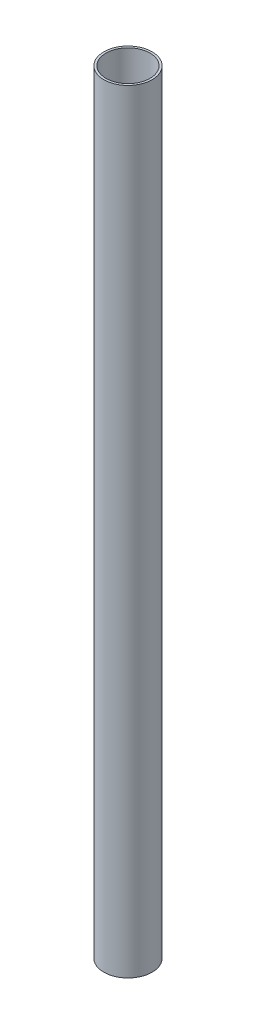
ISO-10303-21;
HEADER;
FILE_DESCRIPTION(('STEP AP214'),'2;1');
FILE_NAME('part.step','',(''),(''),'','','');
FILE_SCHEMA(('AUTOMOTIVE_DESIGN { 1 0 10303 214 1 1 1 1 }'));
ENDSEC;
DATA;
#1=APPLICATION_CONTEXT('core data for automotive mechanical design processes');
#2=APPLICATION_PROTOCOL_DEFINITION('international standard','automotive_design',2000,#1);
#3=PRODUCT_CONTEXT('',#1,'mechanical');
#4=PRODUCT('Part','Part','',(#3));
#5=PRODUCT_RELATED_PRODUCT_CATEGORY('part','',(#4));
#6=PRODUCT_DEFINITION_FORMATION('','',#4);
#7=PRODUCT_DEFINITION_CONTEXT('part definition',#1,'design');
#8=PRODUCT_DEFINITION('design','',#6,#7);
#9=PRODUCT_DEFINITION_SHAPE('','',#8);
#10=(LENGTH_UNIT() NAMED_UNIT(*) SI_UNIT(.MILLI.,.METRE.));
#11=(NAMED_UNIT(*) PLANE_ANGLE_UNIT() SI_UNIT($,.RADIAN.));
#12=(NAMED_UNIT(*) SI_UNIT($,.STERADIAN.) SOLID_ANGLE_UNIT());
#13=UNCERTAINTY_MEASURE_WITH_UNIT(LENGTH_MEASURE(1.E-05),#10,'distance_accuracy_value','');
#14=(GEOMETRIC_REPRESENTATION_CONTEXT(3) GLOBAL_UNCERTAINTY_ASSIGNED_CONTEXT((#13)) GLOBAL_UNIT_ASSIGNED_CONTEXT((#10,
#11,#12)) REPRESENTATION_CONTEXT('',''));
#15=CARTESIAN_POINT('',(0.,0.,0.));
#16=DIRECTION('',(0.,0.,1.));
#17=DIRECTION('',(1.,0.,0.));
#18=AXIS2_PLACEMENT_3D('',#15,#16,#17);
#19=CARTESIAN_POINT('',(0.,254.,0.));
#20=DIRECTION('',(0.,1.,0.));
#21=DIRECTION('',(0.,0.,1.));
#22=AXIS2_PLACEMENT_3D('',#19,#20,#21);
#23=PLANE('',#22);
#24=CARTESIAN_POINT('',(0.,254.,0.));
#25=DIRECTION('',(0.,1.,0.));
#26=DIRECTION('',(0.,0.,1.));
#27=AXIS2_PLACEMENT_3D('',#24,#25,#26);
#28=CIRCLE('',#27,7.9375);
#29=CARTESIAN_POINT('',(0.,254.,7.9375));
#30=VERTEX_POINT('',#29);
#31=EDGE_CURVE('E10',#30,#30,#28,.T.);
#32=ORIENTED_EDGE('',*,*,#31,.T.);
#33=EDGE_LOOP('',(#32));
#34=FACE_BOUND('',#33,.T.);
#35=CARTESIAN_POINT('',(0.,254.,0.));
#36=DIRECTION('',(0.,1.,0.));
#37=DIRECTION('',(0.,0.,1.));
#38=AXIS2_PLACEMENT_3D('',#35,#36,#37);
#39=CIRCLE('',#38,7.2263);
#40=CARTESIAN_POINT('',(0.,254.,7.2263));
#41=VERTEX_POINT('',#40);
#42=EDGE_CURVE('E42',#41,#41,#39,.T.);
#43=ORIENTED_EDGE('',*,*,#42,.F.);
#44=EDGE_LOOP('',(#43));
#45=FACE_BOUND('',#44,.T.);
#46=ADVANCED_FACE('F31',(#34,#45),#23,.T.);
#47=CARTESIAN_POINT('',(0.,0.,0.));
#48=DIRECTION('',(0.,1.,0.));
#49=DIRECTION('',(0.,0.,1.));
#50=AXIS2_PLACEMENT_3D('',#47,#48,#49);
#51=PLANE('',#50);
#52=CARTESIAN_POINT('',(0.,0.,0.));
#53=DIRECTION('',(0.,1.,0.));
#54=DIRECTION('',(0.,0.,1.));
#55=AXIS2_PLACEMENT_3D('',#52,#53,#54);
#56=CIRCLE('',#55,7.9375);
#57=CARTESIAN_POINT('',(0.,0.,7.9375));
#58=VERTEX_POINT('',#57);
#59=EDGE_CURVE('E35',#58,#58,#56,.T.);
#60=ORIENTED_EDGE('',*,*,#59,.F.);
#61=EDGE_LOOP('',(#60));
#62=FACE_BOUND('',#61,.T.);
#63=CARTESIAN_POINT('',(0.,0.,0.));
#64=DIRECTION('',(0.,1.,0.));
#65=DIRECTION('',(0.,0.,1.));
#66=AXIS2_PLACEMENT_3D('',#63,#64,#65);
#67=CIRCLE('',#66,7.2263);
#68=CARTESIAN_POINT('',(0.,0.,7.2263));
#69=VERTEX_POINT('',#68);
#70=EDGE_CURVE('E44',#69,#69,#67,.T.);
#71=ORIENTED_EDGE('',*,*,#70,.T.);
#72=EDGE_LOOP('',(#71));
#73=FACE_BOUND('',#72,.T.);
#74=ADVANCED_FACE('F54',(#62,#73),#51,.F.);
#75=CARTESIAN_POINT('',(0.,254.,0.));
#76=DIRECTION('',(0.,-1.,0.));
#77=DIRECTION('',(0.,0.,-1.));
#78=AXIS2_PLACEMENT_3D('',#75,#76,#77);
#79=CYLINDRICAL_SURFACE('',#78,7.9375);
#80=ORIENTED_EDGE('',*,*,#31,.F.);
#81=EDGE_LOOP('',(#80));
#82=FACE_BOUND('',#81,.T.);
#83=ORIENTED_EDGE('',*,*,#59,.T.);
#84=EDGE_LOOP('',(#83));
#85=FACE_BOUND('',#84,.T.);
#86=ADVANCED_FACE('F33',(#82,#85),#79,.T.);
#87=CARTESIAN_POINT('',(0.,254.,0.));
#88=DIRECTION('',(0.,-1.,0.));
#89=DIRECTION('',(0.,0.,-1.));
#90=AXIS2_PLACEMENT_3D('',#87,#88,#89);
#91=CYLINDRICAL_SURFACE('',#90,7.2263);
#92=ORIENTED_EDGE('',*,*,#42,.T.);
#93=EDGE_LOOP('',(#92));
#94=FACE_BOUND('',#93,.T.);
#95=ORIENTED_EDGE('',*,*,#70,.F.);
#96=EDGE_LOOP('',(#95));
#97=FACE_BOUND('',#96,.T.);
#98=ADVANCED_FACE('F50',(#94,#97),#91,.F.);
#99=CLOSED_SHELL('',(#46,#74,#86,#98));
#100=MANIFOLD_SOLID_BREP('B2',#99);
#101=ADVANCED_BREP_SHAPE_REPRESENTATION('',(#18,#100),#14);
#102=SHAPE_DEFINITION_REPRESENTATION(#9,#101);
ENDSEC;
END-ISO-10303-21;
